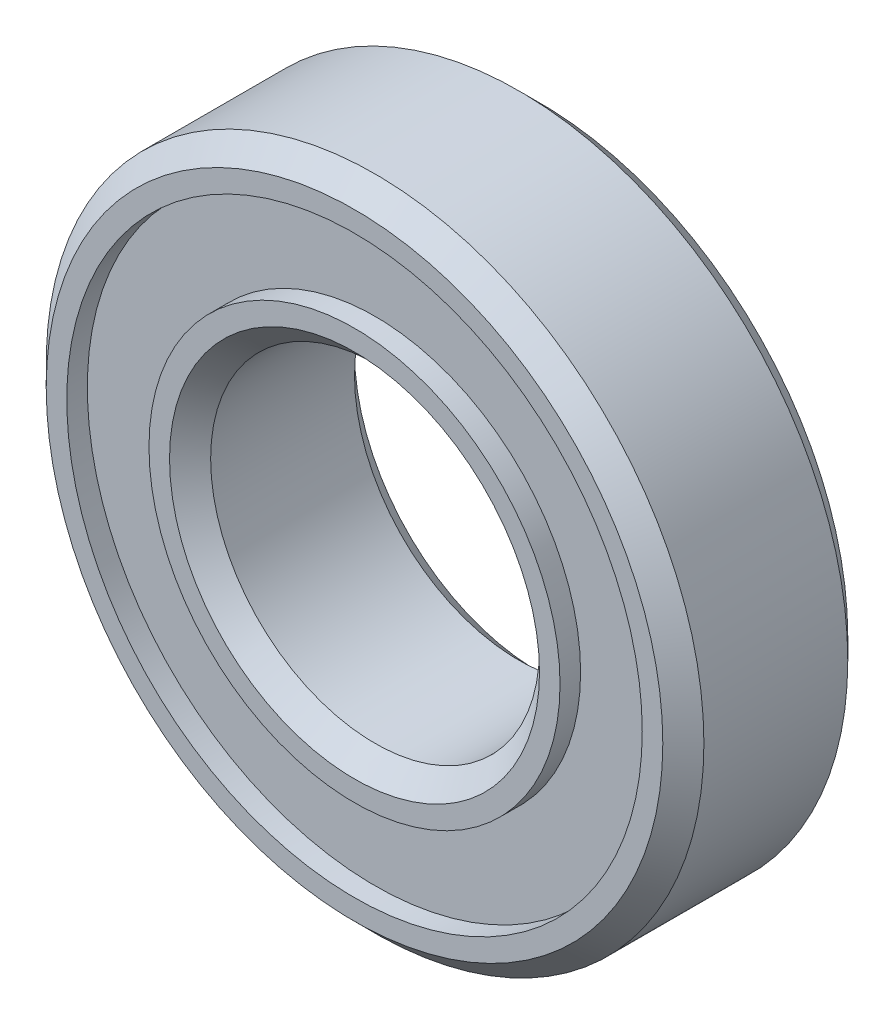
ISO-10303-21;
HEADER;
FILE_DESCRIPTION(('STEP AP214'),'2;1');
FILE_NAME('part.step','',(''),(''),'','','');
FILE_SCHEMA(('AUTOMOTIVE_DESIGN { 1 0 10303 214 1 1 1 1 }'));
ENDSEC;
DATA;
#1=APPLICATION_CONTEXT('core data for automotive mechanical design processes');
#2=APPLICATION_PROTOCOL_DEFINITION('international standard','automotive_design',2000,#1);
#3=PRODUCT_CONTEXT('',#1,'mechanical');
#4=PRODUCT('Part','Part','',(#3));
#5=PRODUCT_RELATED_PRODUCT_CATEGORY('part','',(#4));
#6=PRODUCT_DEFINITION_FORMATION('','',#4);
#7=PRODUCT_DEFINITION_CONTEXT('part definition',#1,'design');
#8=PRODUCT_DEFINITION('design','',#6,#7);
#9=PRODUCT_DEFINITION_SHAPE('','',#8);
#10=(LENGTH_UNIT() NAMED_UNIT(*) SI_UNIT(.MILLI.,.METRE.));
#11=(NAMED_UNIT(*) PLANE_ANGLE_UNIT() SI_UNIT($,.RADIAN.));
#12=(NAMED_UNIT(*) SI_UNIT($,.STERADIAN.) SOLID_ANGLE_UNIT());
#13=UNCERTAINTY_MEASURE_WITH_UNIT(LENGTH_MEASURE(1.E-05),#10,'distance_accuracy_value','');
#14=(GEOMETRIC_REPRESENTATION_CONTEXT(3) GLOBAL_UNCERTAINTY_ASSIGNED_CONTEXT((#13)) GLOBAL_UNIT_ASSIGNED_CONTEXT((#10,
#11,#12)) REPRESENTATION_CONTEXT('',''));
#15=CARTESIAN_POINT('',(0.,0.,0.));
#16=DIRECTION('',(0.,0.,1.));
#17=DIRECTION('',(1.,0.,0.));
#18=AXIS2_PLACEMENT_3D('',#15,#16,#17);
#19=CARTESIAN_POINT('',(0.,0.,4.5));
#20=DIRECTION('',(0.,0.,1.));
#21=DIRECTION('',(1.,0.,0.));
#22=AXIS2_PLACEMENT_3D('',#19,#20,#21);
#23=PLANE('',#22);
#24=CARTESIAN_POINT('',(0.,0.,4.5));
#25=DIRECTION('',(0.,0.,1.));
#26=DIRECTION('',(1.,0.,0.));
#27=AXIS2_PLACEMENT_3D('',#24,#25,#26);
#28=CIRCLE('',#27,4.50000000000001);
#29=CARTESIAN_POINT('',(4.50000000000001,0.,4.5));
#30=VERTEX_POINT('',#29);
#31=EDGE_CURVE('E58',#30,#30,#28,.F.);
#32=ORIENTED_EDGE('',*,*,#31,.T.);
#33=EDGE_LOOP('',(#32));
#34=FACE_BOUND('',#33,.T.);
#35=CARTESIAN_POINT('',(0.,0.,4.5));
#36=DIRECTION('',(0.,0.,1.));
#37=DIRECTION('',(1.,0.,0.));
#38=AXIS2_PLACEMENT_3D('',#35,#36,#37);
#39=CIRCLE('',#38,5.00000000000001);
#40=CARTESIAN_POINT('',(5.00000000000001,0.,4.5));
#41=VERTEX_POINT('',#40);
#42=EDGE_CURVE('E115',#41,#41,#39,.T.);
#43=ORIENTED_EDGE('',*,*,#42,.T.);
#44=EDGE_LOOP('',(#43));
#45=FACE_BOUND('',#44,.T.);
#46=ADVANCED_FACE('F49',(#34,#45),#23,.T.);
#47=CARTESIAN_POINT('',(0.,0.,0.));
#48=DIRECTION('',(0.,0.,1.));
#49=DIRECTION('',(1.,0.,0.));
#50=AXIS2_PLACEMENT_3D('',#47,#48,#49);
#51=PLANE('',#50);
#52=CARTESIAN_POINT('',(0.,0.,0.));
#53=DIRECTION('',(0.,0.,1.));
#54=DIRECTION('',(1.,0.,0.));
#55=AXIS2_PLACEMENT_3D('',#52,#53,#54);
#56=CIRCLE('',#55,4.5);
#57=CARTESIAN_POINT('',(4.5,0.,0.));
#58=VERTEX_POINT('',#57);
#59=EDGE_CURVE('E82',#58,#58,#56,.T.);
#60=ORIENTED_EDGE('',*,*,#59,.T.);
#61=EDGE_LOOP('',(#60));
#62=FACE_BOUND('',#61,.T.);
#63=CARTESIAN_POINT('',(0.,0.,0.));
#64=DIRECTION('',(0.,0.,1.));
#65=DIRECTION('',(1.,0.,0.));
#66=AXIS2_PLACEMENT_3D('',#63,#64,#65);
#67=CIRCLE('',#66,5.00000000000001);
#68=CARTESIAN_POINT('',(5.00000000000001,0.,0.));
#69=VERTEX_POINT('',#68);
#70=EDGE_CURVE('E99',#69,#69,#67,.T.);
#71=ORIENTED_EDGE('',*,*,#70,.F.);
#72=EDGE_LOOP('',(#71));
#73=FACE_BOUND('',#72,.T.);
#74=ADVANCED_FACE('F142',(#62,#73),#51,.F.);
#75=CARTESIAN_POINT('',(0.,0.,4.5));
#76=DIRECTION('',(0.,0.,1.));
#77=DIRECTION('',(1.,0.,0.));
#78=AXIS2_PLACEMENT_3D('',#75,#76,#77);
#79=CIRCLE('',#78,7.);
#80=CARTESIAN_POINT('',(7.,0.,4.5));
#81=VERTEX_POINT('',#80);
#82=EDGE_CURVE('E107',#81,#81,#79,.T.);
#83=ORIENTED_EDGE('',*,*,#82,.F.);
#84=EDGE_LOOP('',(#83));
#85=FACE_BOUND('',#84,.T.);
#86=CARTESIAN_POINT('',(0.,0.,4.5));
#87=DIRECTION('',(0.,0.,1.));
#88=DIRECTION('',(1.,0.,0.));
#89=AXIS2_PLACEMENT_3D('',#86,#87,#88);
#90=CIRCLE('',#89,7.50000000000001);
#91=CARTESIAN_POINT('',(7.50000000000001,0.,4.5));
#92=VERTEX_POINT('',#91);
#93=EDGE_CURVE('E10',#92,#92,#90,.T.);
#94=ORIENTED_EDGE('',*,*,#93,.T.);
#95=EDGE_LOOP('',(#94));
#96=FACE_BOUND('',#95,.T.);
#97=ADVANCED_FACE('F139',(#85,#96),#23,.T.);
#98=CARTESIAN_POINT('',(0.,0.,0.));
#99=DIRECTION('',(0.,0.,1.));
#100=DIRECTION('',(1.,0.,0.));
#101=AXIS2_PLACEMENT_3D('',#98,#99,#100);
#102=CIRCLE('',#101,7.);
#103=CARTESIAN_POINT('',(7.,0.,0.));
#104=VERTEX_POINT('',#103);
#105=EDGE_CURVE('E91',#104,#104,#102,.T.);
#106=ORIENTED_EDGE('',*,*,#105,.T.);
#107=EDGE_LOOP('',(#106));
#108=FACE_BOUND('',#107,.T.);
#109=CARTESIAN_POINT('',(0.,0.,0.));
#110=DIRECTION('',(0.,0.,1.));
#111=DIRECTION('',(1.,0.,0.));
#112=AXIS2_PLACEMENT_3D('',#109,#110,#111);
#113=CIRCLE('',#112,7.49999999999999);
#114=CARTESIAN_POINT('',(7.49999999999999,0.,0.));
#115=VERTEX_POINT('',#114);
#116=EDGE_CURVE('E86',#115,#115,#113,.F.);
#117=ORIENTED_EDGE('',*,*,#116,.T.);
#118=EDGE_LOOP('',(#117));
#119=FACE_BOUND('',#118,.T.);
#120=ADVANCED_FACE('F141',(#108,#119),#51,.F.);
#121=CARTESIAN_POINT('',(0.,0.,4.5));
#122=DIRECTION('',(0.,0.,-1.));
#123=DIRECTION('',(-1.,0.,0.));
#124=AXIS2_PLACEMENT_3D('',#121,#122,#123);
#125=CYLINDRICAL_SURFACE('',#124,8.);
#126=CARTESIAN_POINT('',(0.,0.,0.500000000000002));
#127=DIRECTION('',(0.,0.,1.));
#128=DIRECTION('',(1.,0.,0.));
#129=AXIS2_PLACEMENT_3D('',#126,#127,#128);
#130=CIRCLE('',#129,8.);
#131=CARTESIAN_POINT('',(8.,0.,0.500000000000002));
#132=VERTEX_POINT('',#131);
#133=EDGE_CURVE('E63',#132,#132,#130,.T.);
#134=ORIENTED_EDGE('',*,*,#133,.T.);
#135=EDGE_LOOP('',(#134));
#136=FACE_BOUND('',#135,.T.);
#137=CARTESIAN_POINT('',(0.,0.,4.));
#138=DIRECTION('',(0.,0.,1.));
#139=DIRECTION('',(1.,0.,0.));
#140=AXIS2_PLACEMENT_3D('',#137,#138,#139);
#141=CIRCLE('',#140,8.);
#142=CARTESIAN_POINT('',(8.,0.,4.));
#143=VERTEX_POINT('',#142);
#144=EDGE_CURVE('E68',#143,#143,#141,.F.);
#145=ORIENTED_EDGE('',*,*,#144,.T.);
#146=EDGE_LOOP('',(#145));
#147=FACE_BOUND('',#146,.T.);
#148=ADVANCED_FACE('F148',(#136,#147),#125,.T.);
#149=CARTESIAN_POINT('',(0.,0.,4.5));
#150=DIRECTION('',(0.,0.,-1.));
#151=DIRECTION('',(-1.,0.,0.));
#152=AXIS2_PLACEMENT_3D('',#149,#150,#151);
#153=CYLINDRICAL_SURFACE('',#152,4.);
#154=CARTESIAN_POINT('',(0.,0.,0.500000000000004));
#155=DIRECTION('',(0.,0.,1.));
#156=DIRECTION('',(1.,0.,0.));
#157=AXIS2_PLACEMENT_3D('',#154,#155,#156);
#158=CIRCLE('',#157,4.);
#159=CARTESIAN_POINT('',(4.,0.,0.500000000000004));
#160=VERTEX_POINT('',#159);
#161=EDGE_CURVE('E74',#160,#160,#158,.F.);
#162=ORIENTED_EDGE('',*,*,#161,.T.);
#163=EDGE_LOOP('',(#162));
#164=FACE_BOUND('',#163,.T.);
#165=CARTESIAN_POINT('',(0.,0.,3.99999999999999));
#166=DIRECTION('',(0.,0.,1.));
#167=DIRECTION('',(1.,0.,0.));
#168=AXIS2_PLACEMENT_3D('',#165,#166,#167);
#169=CIRCLE('',#168,4.);
#170=CARTESIAN_POINT('',(4.,0.,3.99999999999999));
#171=VERTEX_POINT('',#170);
#172=EDGE_CURVE('E78',#171,#171,#169,.T.);
#173=ORIENTED_EDGE('',*,*,#172,.T.);
#174=EDGE_LOOP('',(#173));
#175=FACE_BOUND('',#174,.T.);
#176=ADVANCED_FACE('F174',(#164,#175),#153,.F.);
#177=CARTESIAN_POINT('',(0.,0.,0.));
#178=DIRECTION('',(0.,0.,-1.));
#179=DIRECTION('',(-1.,0.,0.));
#180=AXIS2_PLACEMENT_3D('',#177,#178,#179);
#181=CONICAL_SURFACE('',#180,4.5,0.785398163397445);
#182=ORIENTED_EDGE('',*,*,#161,.F.);
#183=EDGE_LOOP('',(#182));
#184=FACE_BOUND('',#183,.T.);
#185=ORIENTED_EDGE('',*,*,#59,.F.);
#186=EDGE_LOOP('',(#185));
#187=FACE_BOUND('',#186,.T.);
#188=ADVANCED_FACE('F176',(#184,#187),#181,.F.);
#189=CARTESIAN_POINT('',(0.,0.,0.500000000000002));
#190=DIRECTION('',(0.,0.,1.));
#191=DIRECTION('',(1.,0.,0.));
#192=AXIS2_PLACEMENT_3D('',#189,#190,#191);
#193=CONICAL_SURFACE('',#192,8.,0.785398163397452);
#194=ORIENTED_EDGE('',*,*,#116,.F.);
#195=EDGE_LOOP('',(#194));
#196=FACE_BOUND('',#195,.T.);
#197=ORIENTED_EDGE('',*,*,#133,.F.);
#198=EDGE_LOOP('',(#197));
#199=FACE_BOUND('',#198,.T.);
#200=ADVANCED_FACE('F182',(#196,#199),#193,.T.);
#201=CARTESIAN_POINT('',(0.,0.,4.5));
#202=DIRECTION('',(0.,0.,-1.));
#203=DIRECTION('',(-1.,0.,0.));
#204=AXIS2_PLACEMENT_3D('',#201,#202,#203);
#205=CONICAL_SURFACE('',#204,7.50000000000001,0.785398163397445);
#206=ORIENTED_EDGE('',*,*,#144,.F.);
#207=EDGE_LOOP('',(#206));
#208=FACE_BOUND('',#207,.T.);
#209=ORIENTED_EDGE('',*,*,#93,.F.);
#210=EDGE_LOOP('',(#209));
#211=FACE_BOUND('',#210,.T.);
#212=ADVANCED_FACE('F192',(#208,#211),#205,.T.);
#213=CARTESIAN_POINT('',(0.,0.,3.99999999999999));
#214=DIRECTION('',(0.,0.,1.));
#215=DIRECTION('',(1.,0.,0.));
#216=AXIS2_PLACEMENT_3D('',#213,#214,#215);
#217=CONICAL_SURFACE('',#216,4.,0.785398163397448);
#218=ORIENTED_EDGE('',*,*,#31,.F.);
#219=EDGE_LOOP('',(#218));
#220=FACE_BOUND('',#219,.T.);
#221=ORIENTED_EDGE('',*,*,#172,.F.);
#222=EDGE_LOOP('',(#221));
#223=FACE_BOUND('',#222,.T.);
#224=ADVANCED_FACE('F52',(#220,#223),#217,.F.);
#225=CARTESIAN_POINT('',(0.,0.,0.5));
#226=DIRECTION('',(0.,0.,1.));
#227=DIRECTION('',(1.,0.,0.));
#228=AXIS2_PLACEMENT_3D('',#225,#226,#227);
#229=PLANE('',#228);
#230=CARTESIAN_POINT('',(0.,0.,0.5));
#231=DIRECTION('',(0.,0.,1.));
#232=DIRECTION('',(1.,0.,0.));
#233=AXIS2_PLACEMENT_3D('',#230,#231,#232);
#234=CIRCLE('',#233,7.);
#235=CARTESIAN_POINT('',(7.,0.,0.5));
#236=VERTEX_POINT('',#235);
#237=EDGE_CURVE('E90',#236,#236,#234,.T.);
#238=ORIENTED_EDGE('',*,*,#237,.F.);
#239=EDGE_LOOP('',(#238));
#240=FACE_BOUND('',#239,.T.);
#241=CARTESIAN_POINT('',(0.,0.,0.5));
#242=DIRECTION('',(0.,0.,1.));
#243=DIRECTION('',(1.,0.,0.));
#244=AXIS2_PLACEMENT_3D('',#241,#242,#243);
#245=CIRCLE('',#244,5.00000000000001);
#246=CARTESIAN_POINT('',(5.00000000000001,0.,0.5));
#247=VERTEX_POINT('',#246);
#248=EDGE_CURVE('E95',#247,#247,#245,.T.);
#249=ORIENTED_EDGE('',*,*,#248,.T.);
#250=EDGE_LOOP('',(#249));
#251=FACE_BOUND('',#250,.T.);
#252=ADVANCED_FACE('F168',(#240,#251),#229,.F.);
#253=CARTESIAN_POINT('',(0.,0.,0.5));
#254=DIRECTION('',(0.,0.,-1.));
#255=DIRECTION('',(-1.,0.,0.));
#256=AXIS2_PLACEMENT_3D('',#253,#254,#255);
#257=CYLINDRICAL_SURFACE('',#256,7.);
#258=ORIENTED_EDGE('',*,*,#237,.T.);
#259=EDGE_LOOP('',(#258));
#260=FACE_BOUND('',#259,.T.);
#261=ORIENTED_EDGE('',*,*,#105,.F.);
#262=EDGE_LOOP('',(#261));
#263=FACE_BOUND('',#262,.T.);
#264=ADVANCED_FACE('F166',(#260,#263),#257,.F.);
#265=CARTESIAN_POINT('',(0.,0.,0.5));
#266=DIRECTION('',(0.,0.,-1.));
#267=DIRECTION('',(-1.,0.,0.));
#268=AXIS2_PLACEMENT_3D('',#265,#266,#267);
#269=CYLINDRICAL_SURFACE('',#268,5.00000000000001);
#270=ORIENTED_EDGE('',*,*,#248,.F.);
#271=EDGE_LOOP('',(#270));
#272=FACE_BOUND('',#271,.T.);
#273=ORIENTED_EDGE('',*,*,#70,.T.);
#274=EDGE_LOOP('',(#273));
#275=FACE_BOUND('',#274,.T.);
#276=ADVANCED_FACE('F135',(#272,#275),#269,.T.);
#277=CARTESIAN_POINT('',(0.,0.,4.));
#278=DIRECTION('',(0.,0.,1.));
#279=DIRECTION('',(1.,0.,0.));
#280=AXIS2_PLACEMENT_3D('',#277,#278,#279);
#281=CYLINDRICAL_SURFACE('',#280,7.);
#282=CARTESIAN_POINT('',(0.,0.,4.));
#283=DIRECTION('',(0.,0.,1.));
#284=DIRECTION('',(1.,0.,0.));
#285=AXIS2_PLACEMENT_3D('',#282,#283,#284);
#286=CIRCLE('',#285,7.);
#287=CARTESIAN_POINT('',(7.,0.,4.));
#288=VERTEX_POINT('',#287);
#289=EDGE_CURVE('E103',#288,#288,#286,.T.);
#290=ORIENTED_EDGE('',*,*,#289,.F.);
#291=EDGE_LOOP('',(#290));
#292=FACE_BOUND('',#291,.T.);
#293=ORIENTED_EDGE('',*,*,#82,.T.);
#294=EDGE_LOOP('',(#293));
#295=FACE_BOUND('',#294,.T.);
#296=ADVANCED_FACE('F129',(#292,#295),#281,.F.);
#297=CARTESIAN_POINT('',(0.,0.,4.));
#298=DIRECTION('',(0.,0.,1.));
#299=DIRECTION('',(1.,0.,0.));
#300=AXIS2_PLACEMENT_3D('',#297,#298,#299);
#301=PLANE('',#300);
#302=CARTESIAN_POINT('',(0.,0.,4.));
#303=DIRECTION('',(0.,0.,1.));
#304=DIRECTION('',(1.,0.,0.));
#305=AXIS2_PLACEMENT_3D('',#302,#303,#304);
#306=CIRCLE('',#305,5.00000000000001);
#307=CARTESIAN_POINT('',(5.00000000000001,0.,4.));
#308=VERTEX_POINT('',#307);
#309=EDGE_CURVE('E111',#308,#308,#306,.T.);
#310=ORIENTED_EDGE('',*,*,#309,.F.);
#311=EDGE_LOOP('',(#310));
#312=FACE_BOUND('',#311,.T.);
#313=ORIENTED_EDGE('',*,*,#289,.T.);
#314=EDGE_LOOP('',(#313));
#315=FACE_BOUND('',#314,.T.);
#316=ADVANCED_FACE('F126',(#312,#315),#301,.T.);
#317=CARTESIAN_POINT('',(0.,0.,4.));
#318=DIRECTION('',(0.,0.,1.));
#319=DIRECTION('',(1.,0.,0.));
#320=AXIS2_PLACEMENT_3D('',#317,#318,#319);
#321=CYLINDRICAL_SURFACE('',#320,5.00000000000001);
#322=ORIENTED_EDGE('',*,*,#309,.T.);
#323=EDGE_LOOP('',(#322));
#324=FACE_BOUND('',#323,.T.);
#325=ORIENTED_EDGE('',*,*,#42,.F.);
#326=EDGE_LOOP('',(#325));
#327=FACE_BOUND('',#326,.T.);
#328=ADVANCED_FACE('F123',(#324,#327),#321,.T.);
#329=CLOSED_SHELL('',(#46,#74,#97,#120,#148,#176,#188,#200,#212,#224,#252,#264,#276,#296,#316,#328));
#330=MANIFOLD_SOLID_BREP('B2',#329);
#331=ADVANCED_BREP_SHAPE_REPRESENTATION('',(#18,#330),#14);
#332=SHAPE_DEFINITION_REPRESENTATION(#9,#331);
ENDSEC;
END-ISO-10303-21;
